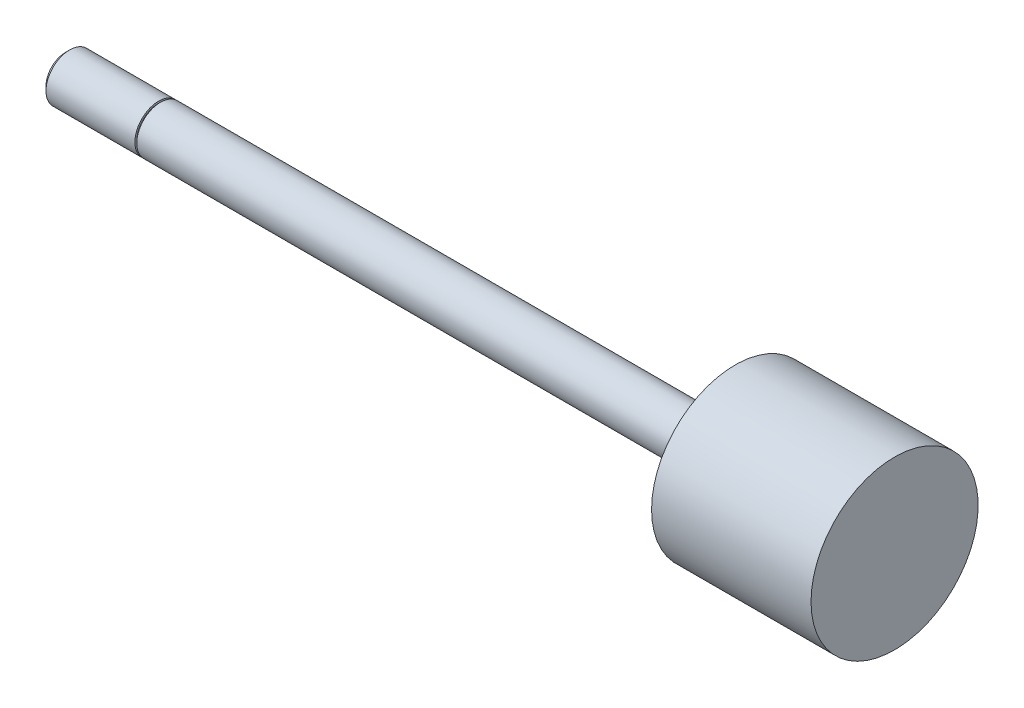
ISO-10303-21;
HEADER;
FILE_DESCRIPTION(('STEP AP214'),'2;1');
FILE_NAME('part.step','',(''),(''),'','','');
FILE_SCHEMA(('AUTOMOTIVE_DESIGN { 1 0 10303 214 1 1 1 1 }'));
ENDSEC;
DATA;
#1=APPLICATION_CONTEXT('core data for automotive mechanical design processes');
#2=APPLICATION_PROTOCOL_DEFINITION('international standard','automotive_design',2000,#1);
#3=PRODUCT_CONTEXT('',#1,'mechanical');
#4=PRODUCT('Part','Part','',(#3));
#5=PRODUCT_RELATED_PRODUCT_CATEGORY('part','',(#4));
#6=PRODUCT_DEFINITION_FORMATION('','',#4);
#7=PRODUCT_DEFINITION_CONTEXT('part definition',#1,'design');
#8=PRODUCT_DEFINITION('design','',#6,#7);
#9=PRODUCT_DEFINITION_SHAPE('','',#8);
#10=(LENGTH_UNIT() NAMED_UNIT(*) SI_UNIT(.MILLI.,.METRE.));
#11=(NAMED_UNIT(*) PLANE_ANGLE_UNIT() SI_UNIT($,.RADIAN.));
#12=(NAMED_UNIT(*) SI_UNIT($,.STERADIAN.) SOLID_ANGLE_UNIT());
#13=UNCERTAINTY_MEASURE_WITH_UNIT(LENGTH_MEASURE(1.E-05),#10,'distance_accuracy_value','');
#14=(GEOMETRIC_REPRESENTATION_CONTEXT(3) GLOBAL_UNCERTAINTY_ASSIGNED_CONTEXT((#13)) GLOBAL_UNIT_ASSIGNED_CONTEXT((#10,
#11,#12)) REPRESENTATION_CONTEXT('',''));
#15=CARTESIAN_POINT('',(0.,0.,0.));
#16=DIRECTION('',(0.,0.,1.));
#17=DIRECTION('',(1.,0.,0.));
#18=AXIS2_PLACEMENT_3D('',#15,#16,#17);
#19=CARTESIAN_POINT('',(98.3488,0.,0.));
#20=DIRECTION('',(-1.,0.,0.));
#21=DIRECTION('',(0.,0.,1.));
#22=AXIS2_PLACEMENT_3D('',#19,#20,#21);
#23=CYLINDRICAL_SURFACE('',#22,3.175);
#24=CARTESIAN_POINT('',(76.9874,0.,0.));
#25=DIRECTION('',(-1.,0.,0.));
#26=DIRECTION('',(0.,0.,1.));
#27=AXIS2_PLACEMENT_3D('',#24,#25,#26);
#28=CIRCLE('',#27,3.175);
#29=CARTESIAN_POINT('',(76.9874,0.,3.175));
#30=VERTEX_POINT('',#29);
#31=EDGE_CURVE('E10',#30,#30,#28,.T.);
#32=ORIENTED_EDGE('',*,*,#31,.T.);
#33=EDGE_LOOP('',(#32));
#34=FACE_BOUND('',#33,.T.);
#35=CARTESIAN_POINT('',(0.,0.,0.));
#36=DIRECTION('',(-1.,0.,0.));
#37=DIRECTION('',(0.,0.,1.));
#38=AXIS2_PLACEMENT_3D('',#35,#36,#37);
#39=CIRCLE('',#38,3.175);
#40=CARTESIAN_POINT('',(0.,0.,3.175));
#41=VERTEX_POINT('',#40);
#42=EDGE_CURVE('E50',#41,#41,#39,.T.);
#43=ORIENTED_EDGE('',*,*,#42,.F.);
#44=EDGE_LOOP('',(#43));
#45=FACE_BOUND('',#44,.T.);
#46=ADVANCED_FACE('F34',(#34,#45),#23,.T.);
#47=CARTESIAN_POINT('',(76.9874,3.175,0.));
#48=DIRECTION('',(1.,0.,0.));
#49=DIRECTION('',(0.,0.,-1.));
#50=AXIS2_PLACEMENT_3D('',#47,#48,#49);
#51=PLANE('',#50);
#52=ORIENTED_EDGE('',*,*,#31,.F.);
#53=EDGE_LOOP('',(#52));
#54=FACE_BOUND('',#53,.T.);
#55=CARTESIAN_POINT('',(76.9874,0.,0.));
#56=DIRECTION('',(-1.,0.,0.));
#57=DIRECTION('',(0.,0.,1.));
#58=AXIS2_PLACEMENT_3D('',#55,#56,#57);
#59=CIRCLE('',#58,11.19505);
#60=CARTESIAN_POINT('',(76.9874,0.,11.19505));
#61=VERTEX_POINT('',#60);
#62=EDGE_CURVE('E42',#61,#61,#59,.T.);
#63=ORIENTED_EDGE('',*,*,#62,.T.);
#64=EDGE_LOOP('',(#63));
#65=FACE_BOUND('',#64,.T.);
#66=ADVANCED_FACE('F84',(#54,#65),#51,.F.);
#67=CARTESIAN_POINT('',(98.3488,0.,0.));
#68=DIRECTION('',(-1.,0.,0.));
#69=DIRECTION('',(0.,0.,1.));
#70=AXIS2_PLACEMENT_3D('',#67,#68,#69);
#71=CYLINDRICAL_SURFACE('',#70,11.19505);
#72=ORIENTED_EDGE('',*,*,#62,.F.);
#73=EDGE_LOOP('',(#72));
#74=FACE_BOUND('',#73,.T.);
#75=CARTESIAN_POINT('',(98.3488,0.,0.));
#76=DIRECTION('',(-1.,0.,0.));
#77=DIRECTION('',(0.,0.,1.));
#78=AXIS2_PLACEMENT_3D('',#75,#76,#77);
#79=CIRCLE('',#78,11.19505);
#80=CARTESIAN_POINT('',(98.3488,0.,11.19505));
#81=VERTEX_POINT('',#80);
#82=EDGE_CURVE('E47',#81,#81,#79,.T.);
#83=ORIENTED_EDGE('',*,*,#82,.T.);
#84=EDGE_LOOP('',(#83));
#85=FACE_BOUND('',#84,.T.);
#86=ADVANCED_FACE('F72',(#74,#85),#71,.T.);
#87=CARTESIAN_POINT('',(98.3488,11.19505,0.));
#88=DIRECTION('',(-1.,0.,0.));
#89=DIRECTION('',(0.,0.,1.));
#90=AXIS2_PLACEMENT_3D('',#87,#88,#89);
#91=PLANE('',#90);
#92=ORIENTED_EDGE('',*,*,#82,.F.);
#93=EDGE_LOOP('',(#92));
#94=FACE_BOUND('',#93,.T.);
#95=ADVANCED_FACE('F74',(#94),#91,.F.);
#96=CARTESIAN_POINT('',(-0.254,3.429,0.));
#97=DIRECTION('',(1.,0.,0.));
#98=DIRECTION('',(0.,0.,-1.));
#99=AXIS2_PLACEMENT_3D('',#96,#97,#98);
#100=PLANE('',#99);
#101=CARTESIAN_POINT('',(-0.254,0.,0.));
#102=DIRECTION('',(-1.,0.,0.));
#103=DIRECTION('',(0.,0.,1.));
#104=AXIS2_PLACEMENT_3D('',#101,#102,#103);
#105=CIRCLE('',#104,2.921);
#106=CARTESIAN_POINT('',(-0.254,0.,2.921));
#107=VERTEX_POINT('',#106);
#108=EDGE_CURVE('E52',#107,#107,#105,.T.);
#109=ORIENTED_EDGE('',*,*,#108,.T.);
#110=EDGE_LOOP('',(#109));
#111=FACE_BOUND('',#110,.T.);
#112=CARTESIAN_POINT('',(-0.254000000000004,0.,0.));
#113=DIRECTION('',(1.,0.,0.));
#114=DIRECTION('',(0.,0.,-1.));
#115=AXIS2_PLACEMENT_3D('',#112,#113,#114);
#116=CIRCLE('',#115,3.175);
#117=CARTESIAN_POINT('',(-0.254000000000004,0.,-3.175));
#118=VERTEX_POINT('',#117);
#119=EDGE_CURVE('E38',#118,#118,#116,.T.);
#120=ORIENTED_EDGE('',*,*,#119,.T.);
#121=EDGE_LOOP('',(#120));
#122=FACE_BOUND('',#121,.T.);
#123=ADVANCED_FACE('F76',(#111,#122),#100,.T.);
#124=CARTESIAN_POINT('',(0.,2.921,0.));
#125=DIRECTION('',(-1.,0.,0.));
#126=DIRECTION('',(0.,0.,1.));
#127=AXIS2_PLACEMENT_3D('',#124,#125,#126);
#128=PLANE('',#127);
#129=CARTESIAN_POINT('',(0.,0.,0.));
#130=DIRECTION('',(-1.,0.,0.));
#131=DIRECTION('',(0.,0.,1.));
#132=AXIS2_PLACEMENT_3D('',#129,#130,#131);
#133=CIRCLE('',#132,2.921);
#134=CARTESIAN_POINT('',(0.,0.,2.921));
#135=VERTEX_POINT('',#134);
#136=EDGE_CURVE('E58',#135,#135,#133,.T.);
#137=ORIENTED_EDGE('',*,*,#136,.F.);
#138=EDGE_LOOP('',(#137));
#139=FACE_BOUND('',#138,.T.);
#140=ORIENTED_EDGE('',*,*,#42,.T.);
#141=EDGE_LOOP('',(#140));
#142=FACE_BOUND('',#141,.T.);
#143=ADVANCED_FACE('F82',(#139,#142),#128,.T.);
#144=CARTESIAN_POINT('',(0.,0.,0.));
#145=DIRECTION('',(-1.,0.,0.));
#146=DIRECTION('',(0.,0.,1.));
#147=AXIS2_PLACEMENT_3D('',#144,#145,#146);
#148=CYLINDRICAL_SURFACE('',#147,2.921);
#149=ORIENTED_EDGE('',*,*,#136,.T.);
#150=EDGE_LOOP('',(#149));
#151=FACE_BOUND('',#150,.T.);
#152=ORIENTED_EDGE('',*,*,#108,.F.);
#153=EDGE_LOOP('',(#152));
#154=FACE_BOUND('',#153,.T.);
#155=ADVANCED_FACE('F111',(#151,#154),#148,.T.);
#156=CARTESIAN_POINT('',(-12.7,0.,0.));
#157=DIRECTION('',(1.,0.,0.));
#158=DIRECTION('',(0.,0.,-1.));
#159=AXIS2_PLACEMENT_3D('',#156,#157,#158);
#160=PLANE('',#159);
#161=CARTESIAN_POINT('',(-12.7,0.,0.));
#162=DIRECTION('',(-1.,0.,0.));
#163=DIRECTION('',(0.,0.,1.));
#164=AXIS2_PLACEMENT_3D('',#161,#162,#163);
#165=CIRCLE('',#164,2.63398);
#166=CARTESIAN_POINT('',(-12.7,0.,2.63398));
#167=VERTEX_POINT('',#166);
#168=EDGE_CURVE('E67',#167,#167,#165,.T.);
#169=ORIENTED_EDGE('',*,*,#168,.T.);
#170=EDGE_LOOP('',(#169));
#171=FACE_BOUND('',#170,.T.);
#172=ADVANCED_FACE('F100',(#171),#160,.F.);
#173=CARTESIAN_POINT('',(-12.15898,0.,0.));
#174=DIRECTION('',(1.,0.,0.));
#175=DIRECTION('',(0.,0.,-1.));
#176=AXIS2_PLACEMENT_3D('',#173,#174,#175);
#177=CONICAL_SURFACE('',#176,3.175,0.785398163397448);
#178=ORIENTED_EDGE('',*,*,#168,.F.);
#179=EDGE_LOOP('',(#178));
#180=FACE_BOUND('',#179,.T.);
#181=CARTESIAN_POINT('',(-12.15898,0.,0.));
#182=DIRECTION('',(-1.,0.,0.));
#183=DIRECTION('',(0.,0.,1.));
#184=AXIS2_PLACEMENT_3D('',#181,#182,#183);
#185=CIRCLE('',#184,3.175);
#186=CARTESIAN_POINT('',(-12.15898,0.,3.175));
#187=VERTEX_POINT('',#186);
#188=EDGE_CURVE('E56',#187,#187,#185,.T.);
#189=ORIENTED_EDGE('',*,*,#188,.T.);
#190=EDGE_LOOP('',(#189));
#191=FACE_BOUND('',#190,.T.);
#192=ADVANCED_FACE('F95',(#180,#191),#177,.T.);
#193=ORIENTED_EDGE('',*,*,#188,.F.);
#194=EDGE_LOOP('',(#193));
#195=FACE_BOUND('',#194,.T.);
#196=ORIENTED_EDGE('',*,*,#119,.F.);
#197=EDGE_LOOP('',(#196));
#198=FACE_BOUND('',#197,.T.);
#199=ADVANCED_FACE('F36',(#195,#198),#23,.T.);
#200=CLOSED_SHELL('',(#46,#66,#86,#95,#123,#143,#155,#172,#192,#199));
#201=MANIFOLD_SOLID_BREP('B2',#200);
#202=ADVANCED_BREP_SHAPE_REPRESENTATION('',(#18,#201),#14);
#203=SHAPE_DEFINITION_REPRESENTATION(#9,#202);
ENDSEC;
END-ISO-10303-21;
